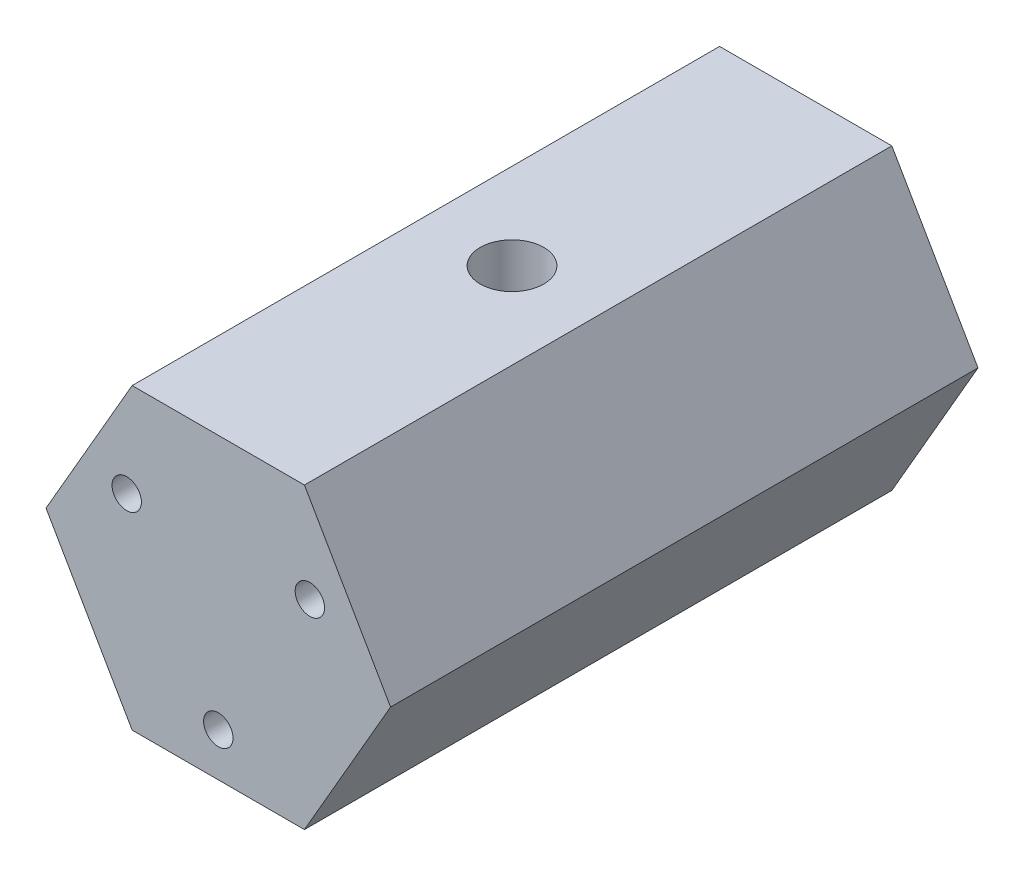
ISO-10303-21;
HEADER;
FILE_DESCRIPTION(('STEP AP214'),'2;1');
FILE_NAME('part.step','',(''),(''),'','','');
FILE_SCHEMA(('AUTOMOTIVE_DESIGN { 1 0 10303 214 1 1 1 1 }'));
ENDSEC;
DATA;
#1=APPLICATION_CONTEXT('core data for automotive mechanical design processes');
#2=APPLICATION_PROTOCOL_DEFINITION('international standard','automotive_design',2000,#1);
#3=PRODUCT_CONTEXT('',#1,'mechanical');
#4=PRODUCT('Part','Part','',(#3));
#5=PRODUCT_RELATED_PRODUCT_CATEGORY('part','',(#4));
#6=PRODUCT_DEFINITION_FORMATION('','',#4);
#7=PRODUCT_DEFINITION_CONTEXT('part definition',#1,'design');
#8=PRODUCT_DEFINITION('design','',#6,#7);
#9=PRODUCT_DEFINITION_SHAPE('','',#8);
#10=(LENGTH_UNIT() NAMED_UNIT(*) SI_UNIT(.MILLI.,.METRE.));
#11=(NAMED_UNIT(*) PLANE_ANGLE_UNIT() SI_UNIT($,.RADIAN.));
#12=(NAMED_UNIT(*) SI_UNIT($,.STERADIAN.) SOLID_ANGLE_UNIT());
#13=UNCERTAINTY_MEASURE_WITH_UNIT(LENGTH_MEASURE(1.E-05),#10,'distance_accuracy_value','');
#14=(GEOMETRIC_REPRESENTATION_CONTEXT(3) GLOBAL_UNCERTAINTY_ASSIGNED_CONTEXT((#13)) GLOBAL_UNIT_ASSIGNED_CONTEXT((#10,
#11,#12)) REPRESENTATION_CONTEXT('',''));
#15=CARTESIAN_POINT('',(0.,0.,0.));
#16=DIRECTION('',(0.,0.,1.));
#17=DIRECTION('',(1.,0.,0.));
#18=AXIS2_PLACEMENT_3D('',#15,#16,#17);
#19=CARTESIAN_POINT('',(0.,-9.,50.));
#20=DIRECTION('',(0.,0.,-1.));
#21=DIRECTION('',(-1.,0.,0.));
#22=AXIS2_PLACEMENT_3D('',#19,#20,#21);
#23=CYLINDRICAL_SURFACE('',#22,1.25);
#24=CARTESIAN_POINT('',(-1.25,-9.,27.3989718651956));
#25=CARTESIAN_POINT('',(-1.2499962908613,-9.06586986361938,27.398976108096));
#26=CARTESIAN_POINT('',(-1.24475969173911,-9.13183941692029,27.401724798307));
#27=CARTESIAN_POINT('',(-1.22405351673539,-9.26181198084871,27.4123405674276));
#28=CARTESIAN_POINT('',(-1.20855931274693,-9.32580986961136,27.4202199642128));
#29=CARTESIAN_POINT('',(-1.1681089062806,-9.4497210916039,27.4399973431834));
#30=CARTESIAN_POINT('',(-1.14319733296454,-9.5096521416213,27.4518763425534));
#31=CARTESIAN_POINT('',(-1.08475416077961,-9.6244696071343,27.4782855403419));
#32=CARTESIAN_POINT('',(-1.05122324496487,-9.67935642190105,27.492815528652));
#33=CARTESIAN_POINT('',(-0.973737596481966,-9.78677914162772,27.5241362491608));
#34=CARTESIAN_POINT('',(-0.929218016269601,-9.83888244410461,27.5410140158933));
#35=CARTESIAN_POINT('',(-0.832198977115679,-9.93521174089873,27.5744208840005));
#36=CARTESIAN_POINT('',(-0.779696018983542,-9.97943426244286,27.5909498288478));
#37=CARTESIAN_POINT('',(-0.664629367480696,-10.0611387690122,27.6228969271712));
#38=CARTESIAN_POINT('',(-0.601668900352655,-10.0981100931469,27.6382024312842));
#39=CARTESIAN_POINT('',(-0.469583995016043,-10.1607429880959,27.6648798127316));
#40=CARTESIAN_POINT('',(-0.400462917397401,-10.1864106801457,27.6762538183636));
#41=CARTESIAN_POINT('',(-0.262583411801329,-10.2240645190013,27.6931645402977));
#42=CARTESIAN_POINT('',(-0.194070526797673,-10.2368032206962,27.6990206973328));
#43=CARTESIAN_POINT('',(-0.0556473489475123,-10.250693711679,27.7054131334755));
#44=CARTESIAN_POINT('',(0.0142622175853111,-10.2518513739671,27.705952109041));
#45=CARTESIAN_POINT('',(0.147926390209878,-10.242887277595,27.7018186229592));
#46=CARTESIAN_POINT('',(0.211751347651894,-10.2335998731223,27.6975316356642));
#47=CARTESIAN_POINT('',(0.336816704159386,-10.2054723055395,27.6847854427952));
#48=CARTESIAN_POINT('',(0.398056911035302,-10.1866314334303,27.6763259275634));
#49=CARTESIAN_POINT('',(0.517342250750538,-10.1397488785234,27.6558696183459));
#50=CARTESIAN_POINT('',(0.575325643467709,-10.1115733627662,27.6438216457579));
#51=CARTESIAN_POINT('',(0.685891819018301,-10.0469748797201,27.6173183976194));
#52=CARTESIAN_POINT('',(0.738472610891999,-10.0105488877093,27.6028622397153));
#53=CARTESIAN_POINT('',(0.841429586015191,-9.92695915150233,27.5715161570508));
#54=CARTESIAN_POINT('',(0.891252613899297,-9.8791517350186,27.5545238010416));
#55=CARTESIAN_POINT('',(0.982446372854443,-9.77591687708416,27.5208595496417));
#56=CARTESIAN_POINT('',(1.02381222041914,-9.72048506373543,27.5041878444122));
#57=CARTESIAN_POINT('',(1.09882835295182,-9.60027521438755,27.4722230091738));
#58=CARTESIAN_POINT('',(1.13201318234461,-9.53517634292615,27.4570344118266));
#59=CARTESIAN_POINT('',(1.18671513185648,-9.39943535417648,27.4310902831621));
#60=CARTESIAN_POINT('',(1.20824275446202,-9.32879829240236,27.4203307635986));
#61=CARTESIAN_POINT('',(1.23744013480248,-9.18953090961133,27.4055267075853));
#62=CARTESIAN_POINT('',(1.24601720947144,-9.12113867690143,27.4010443158241));
#63=CARTESIAN_POINT('',(1.25178108091602,-8.98375987560681,27.3980459872056));
#64=CARTESIAN_POINT('',(1.24897361665329,-8.91477362396575,27.3995270441629));
#65=CARTESIAN_POINT('',(1.23287972640388,-8.78449739492194,27.4078288141744));
#66=CARTESIAN_POINT('',(1.22052158557729,-8.72305819069472,27.4141761321361));
#67=CARTESIAN_POINT('',(1.18698406740991,-8.60320852976553,27.4308399228512));
#68=CARTESIAN_POINT('',(1.16580227607406,-8.54479890682478,27.4411574817334));
#69=CARTESIAN_POINT('',(1.11416745221313,-8.42965431687843,27.4651653096152));
#70=CARTESIAN_POINT('',(1.08333435705616,-8.37311844841991,27.47898836368));
#71=CARTESIAN_POINT('',(1.01362317458948,-8.26571693468951,27.5082987896109));
#72=CARTESIAN_POINT('',(0.974741147814142,-8.2148540848464,27.5237869746671));
#73=CARTESIAN_POINT('',(0.885277137482153,-8.11470408564449,27.5566281182141));
#74=CARTESIAN_POINT('',(0.833897823239853,-8.06613460280701,27.5740070833917));
#75=CARTESIAN_POINT('',(0.72337129677926,-7.97812694643838,27.6072260640207));
#76=CARTESIAN_POINT('',(0.664222575831666,-7.93869055056797,27.6230657795255));
#77=CARTESIAN_POINT('',(0.53863346210164,-7.8697031568715,27.6517235015948));
#78=CARTESIAN_POINT('',(0.472106525645689,-7.84029066286391,27.6644985011312));
#79=CARTESIAN_POINT('',(0.334293907815896,-7.79333693299922,27.6852662042964));
#80=CARTESIAN_POINT('',(0.263011822407703,-7.77578683583925,27.6932624771528));
#81=CARTESIAN_POINT('',(0.124046543478271,-7.75435046641577,27.7030774611194));
#82=CARTESIAN_POINT('',(0.0565498732469495,-7.74945866858606,27.7053503634318));
#83=CARTESIAN_POINT('',(-0.0783182584763698,-7.75063610539858,27.704805843157));
#84=CARTESIAN_POINT('',(-0.145689747620479,-7.7567025316607,27.7019897247871));
#85=CARTESIAN_POINT('',(-0.274831857038451,-7.77891667400426,27.6918434330981));
#86=CARTESIAN_POINT('',(-0.336713300477791,-7.794537995852,27.6847492172009));
#87=CARTESIAN_POINT('',(-0.456913694075798,-7.83477514286399,27.6669253090312));
#88=CARTESIAN_POINT('',(-0.515232053746472,-7.85939245418455,27.6561950160925));
#89=CARTESIAN_POINT('',(-0.629602207885975,-7.9181398119282,27.6314911999344));
#90=CARTESIAN_POINT('',(-0.68542990866064,-7.95265194593216,27.6173922548961));
#91=CARTESIAN_POINT('',(-0.790746703906991,-8.0297002621939,27.5875252904111));
#92=CARTESIAN_POINT('',(-0.840232958219822,-8.07224001885893,27.5717565288339));
#93=CARTESIAN_POINT('',(-0.935899775436062,-8.16838980788918,27.5385892333557));
#94=CARTESIAN_POINT('',(-0.981435111736464,-8.22263564101142,27.5211667030821));
#95=CARTESIAN_POINT('',(-1.06292754091002,-8.33841288529576,27.4879095982203));
#96=CARTESIAN_POINT('',(-1.09887803635555,-8.39994927281872,27.4720761220588));
#97=CARTESIAN_POINT('',(-1.16038377050151,-8.52965979502022,27.4438165122321));
#98=CARTESIAN_POINT('',(-1.18581696607985,-8.59790107220055,27.4314308986784));
#99=CARTESIAN_POINT('',(-1.22446825578866,-8.73837809131262,27.4122029737783));
#100=CARTESIAN_POINT('',(-1.23772735891815,-8.81059954770739,27.4053420618952));
#101=CARTESIAN_POINT('',(-1.24636902621053,-8.90281123520539,27.4008603958595));
#102=CARTESIAN_POINT('',(-1.2477291025588,-8.92221436170823,27.4001539569982));
#103=CARTESIAN_POINT('',(-1.2495451565744,-8.96107542169026,27.3992090548565));
#104=CARTESIAN_POINT('',(-1.25000109616862,-8.98053335744292,27.3989706112834));
#105=CARTESIAN_POINT('',(-1.25,-9.,27.3989718651956));
#106=B_SPLINE_CURVE_WITH_KNOTS('',3,(#24,#25,#26,#27,#28,#29,#30,#31,#32,#33,#34,#35,#36,#37,
#38,#39,#40,#41,#42,#43,#44,#45,#46,#47,#48,#49,#50,#51,#52,#53,#54,#55,#56,#57,#58,#59,#60,#61,
#62,#63,#64,#65,#66,#67,#68,#69,#70,#71,#72,#73,#74,#75,#76,#77,#78,#79,#80,#81,#82,#83,#84,#85,
#86,#87,#88,#89,#90,#91,#92,#93,#94,#95,#96,#97,#98,#99,#100,#101,#102,#103,#104,#105),
.UNSPECIFIED.,.T.,.F.,(4,2,2,2,2,2,2,2,2,2,2,2,2,2,2,2,2,2,2,2,2,2,2,2,2,2,2,2,2,2,2,2,2,2,2,2,
2,2,2,2,4),(0.,0.197527759686264,0.395531504143049,0.59260843343527,0.789669749850622,
1.00050754653747,1.21143802325072,1.43408138198829,1.65660402436703,1.86526736114843,
2.07382487478769,2.26683616648361,2.45986178437431,2.65578412759156,2.85177841484428,
3.06418214037597,3.27670817184753,3.49943184569688,3.72195452278757,3.92801635582216,
4.1339743257215,4.32210098743811,4.51027915112595,4.70707257792227,4.90396255190884,
5.12138831106846,5.33885635439823,5.55921775927923,5.77941437000867,5.98149156508768,
6.1835169790516,6.37530576455118,6.56712624829417,6.76768042333846,6.96832410944356,
7.18613703092828,7.40409949235945,7.62452466126934,7.84420456404469,7.90257784995653,
7.96095359391027),.UNSPECIFIED.);
#107=CARTESIAN_POINT('',(-1.25,-9.,27.3989718651956));
#108=VERTEX_POINT('',#107);
#109=EDGE_CURVE('E52',#108,#108,#106,.T.);
#110=ORIENTED_EDGE('',*,*,#109,.F.);
#111=EDGE_LOOP('',(#110));
#112=FACE_BOUND('',#111,.T.);
#113=CARTESIAN_POINT('',(0.,-9.,50.));
#114=DIRECTION('',(0.,0.,1.));
#115=DIRECTION('',(1.,0.,0.));
#116=AXIS2_PLACEMENT_3D('',#113,#114,#115);
#117=CIRCLE('',#116,1.25);
#118=CARTESIAN_POINT('',(1.25,-9.,50.));
#119=VERTEX_POINT('',#118);
#120=EDGE_CURVE('E193',#119,#119,#117,.T.);
#121=ORIENTED_EDGE('',*,*,#120,.T.);
#122=EDGE_LOOP('',(#121));
#123=FACE_BOUND('',#122,.T.);
#124=ADVANCED_FACE('F48',(#112,#123),#23,.F.);
#125=CARTESIAN_POINT('',(0.,0.,50.));
#126=DIRECTION('',(0.,0.,1.));
#127=DIRECTION('',(1.,0.,0.));
#128=AXIS2_PLACEMENT_3D('',#125,#126,#127);
#129=PLANE('',#128);
#130=CARTESIAN_POINT('',(7.79422863405994,4.5,50.));
#131=DIRECTION('',(0.,0.,1.));
#132=DIRECTION('',(1.,0.,0.));
#133=AXIS2_PLACEMENT_3D('',#130,#131,#132);
#134=CIRCLE('',#133,1.25);
#135=CARTESIAN_POINT('',(9.04422863405995,4.5,50.));
#136=VERTEX_POINT('',#135);
#137=EDGE_CURVE('E199',#136,#136,#134,.T.);
#138=ORIENTED_EDGE('',*,*,#137,.F.);
#139=EDGE_LOOP('',(#138));
#140=FACE_BOUND('',#139,.T.);
#141=DIRECTION('',(0.5,-0.866025403784438,0.));
#142=VECTOR('',#141,1.);
#143=CARTESIAN_POINT('',(-14.6646968374165,0.,50.));
#144=LINE('',#143,#142);
#145=CARTESIAN_POINT('',(-14.6646968374165,0.,50.));
#146=VERTEX_POINT('',#145);
#147=CARTESIAN_POINT('',(-7.33234841870824,-12.7,50.));
#148=VERTEX_POINT('',#147);
#149=EDGE_CURVE('E152',#146,#148,#144,.T.);
#150=ORIENTED_EDGE('',*,*,#149,.T.);
#151=DIRECTION('',(1.,0.,0.));
#152=VECTOR('',#151,1.);
#153=CARTESIAN_POINT('',(-7.33234841870824,-12.7,50.));
#154=LINE('',#153,#152);
#155=CARTESIAN_POINT('',(7.33234841870825,-12.7,50.));
#156=VERTEX_POINT('',#155);
#157=EDGE_CURVE('E109',#148,#156,#154,.T.);
#158=ORIENTED_EDGE('',*,*,#157,.T.);
#159=DIRECTION('',(0.5,0.866025403784439,0.));
#160=VECTOR('',#159,1.);
#161=CARTESIAN_POINT('',(7.33234841870825,-12.7,50.));
#162=LINE('',#161,#160);
#163=CARTESIAN_POINT('',(14.6646968374165,0.,50.));
#164=VERTEX_POINT('',#163);
#165=EDGE_CURVE('E123',#156,#164,#162,.T.);
#166=ORIENTED_EDGE('',*,*,#165,.T.);
#167=DIRECTION('',(-0.5,0.866025403784438,0.));
#168=VECTOR('',#167,1.);
#169=CARTESIAN_POINT('',(14.6646968374165,0.,50.));
#170=LINE('',#169,#168);
#171=CARTESIAN_POINT('',(7.33234841870824,12.7,50.));
#172=VERTEX_POINT('',#171);
#173=EDGE_CURVE('E116',#164,#172,#170,.T.);
#174=ORIENTED_EDGE('',*,*,#173,.T.);
#175=DIRECTION('',(-1.,0.,0.));
#176=VECTOR('',#175,1.);
#177=CARTESIAN_POINT('',(7.33234841870824,12.7,50.));
#178=LINE('',#177,#176);
#179=CARTESIAN_POINT('',(-7.33234841870825,12.7,50.));
#180=VERTEX_POINT('',#179);
#181=EDGE_CURVE('E121',#172,#180,#178,.T.);
#182=ORIENTED_EDGE('',*,*,#181,.T.);
#183=DIRECTION('',(-0.5,-0.866025403784439,0.));
#184=VECTOR('',#183,1.);
#185=CARTESIAN_POINT('',(-7.33234841870825,12.7,50.));
#186=LINE('',#185,#184);
#187=EDGE_CURVE('E72',#180,#146,#186,.T.);
#188=ORIENTED_EDGE('',*,*,#187,.T.);
#189=EDGE_LOOP('',(#150,#158,#166,#174,#182,#188));
#190=FACE_BOUND('',#189,.T.);
#191=CARTESIAN_POINT('',(-7.79422863405994,4.5,50.));
#192=DIRECTION('',(0.,0.,1.));
#193=DIRECTION('',(1.,0.,0.));
#194=AXIS2_PLACEMENT_3D('',#191,#192,#193);
#195=CIRCLE('',#194,1.25);
#196=CARTESIAN_POINT('',(-6.54422863405995,4.5,50.));
#197=VERTEX_POINT('',#196);
#198=EDGE_CURVE('E145',#197,#197,#195,.T.);
#199=ORIENTED_EDGE('',*,*,#198,.F.);
#200=EDGE_LOOP('',(#199));
#201=FACE_BOUND('',#200,.T.);
#202=ORIENTED_EDGE('',*,*,#120,.F.);
#203=EDGE_LOOP('',(#202));
#204=FACE_BOUND('',#203,.T.);
#205=ADVANCED_FACE('F118',(#140,#190,#201,#204),#129,.T.);
#206=CARTESIAN_POINT('',(0.,0.,0.));
#207=DIRECTION('',(0.,0.,1.));
#208=DIRECTION('',(1.,0.,0.));
#209=AXIS2_PLACEMENT_3D('',#206,#207,#208);
#210=PLANE('',#209);
#211=DIRECTION('',(0.5,-0.866025403784438,0.));
#212=VECTOR('',#211,1.);
#213=CARTESIAN_POINT('',(-14.6646968374165,0.,0.));
#214=LINE('',#213,#212);
#215=CARTESIAN_POINT('',(-14.6646968374165,0.,0.));
#216=VERTEX_POINT('',#215);
#217=CARTESIAN_POINT('',(-7.33234841870824,-12.7,0.));
#218=VERTEX_POINT('',#217);
#219=EDGE_CURVE('E141',#216,#218,#214,.T.);
#220=ORIENTED_EDGE('',*,*,#219,.F.);
#221=DIRECTION('',(-0.5,-0.866025403784439,0.));
#222=VECTOR('',#221,1.);
#223=CARTESIAN_POINT('',(-7.33234841870825,12.7,0.));
#224=LINE('',#223,#222);
#225=CARTESIAN_POINT('',(-7.33234841870825,12.7,0.));
#226=VERTEX_POINT('',#225);
#227=EDGE_CURVE('E101',#226,#216,#224,.T.);
#228=ORIENTED_EDGE('',*,*,#227,.F.);
#229=DIRECTION('',(-1.,0.,0.));
#230=VECTOR('',#229,1.);
#231=CARTESIAN_POINT('',(7.33234841870824,12.7,0.));
#232=LINE('',#231,#230);
#233=CARTESIAN_POINT('',(7.33234841870824,12.7,0.));
#234=VERTEX_POINT('',#233);
#235=EDGE_CURVE('E95',#234,#226,#232,.T.);
#236=ORIENTED_EDGE('',*,*,#235,.F.);
#237=DIRECTION('',(-0.5,0.866025403784438,0.));
#238=VECTOR('',#237,1.);
#239=CARTESIAN_POINT('',(14.6646968374165,0.,0.));
#240=LINE('',#239,#238);
#241=CARTESIAN_POINT('',(14.6646968374165,0.,0.));
#242=VERTEX_POINT('',#241);
#243=EDGE_CURVE('E131',#242,#234,#240,.T.);
#244=ORIENTED_EDGE('',*,*,#243,.F.);
#245=DIRECTION('',(0.5,0.866025403784439,0.));
#246=VECTOR('',#245,1.);
#247=CARTESIAN_POINT('',(7.33234841870825,-12.7,0.));
#248=LINE('',#247,#246);
#249=CARTESIAN_POINT('',(7.33234841870825,-12.7,0.));
#250=VERTEX_POINT('',#249);
#251=EDGE_CURVE('E147',#250,#242,#248,.T.);
#252=ORIENTED_EDGE('',*,*,#251,.F.);
#253=DIRECTION('',(1.,0.,0.));
#254=VECTOR('',#253,1.);
#255=CARTESIAN_POINT('',(-7.33234841870824,-12.7,0.));
#256=LINE('',#255,#254);
#257=EDGE_CURVE('E144',#218,#250,#256,.T.);
#258=ORIENTED_EDGE('',*,*,#257,.F.);
#259=EDGE_LOOP('',(#220,#228,#236,#244,#252,#258));
#260=FACE_BOUND('',#259,.T.);
#261=CARTESIAN_POINT('',(-7.79422863405994,4.5,0.));
#262=DIRECTION('',(0.,0.,1.));
#263=DIRECTION('',(1.,0.,0.));
#264=AXIS2_PLACEMENT_3D('',#261,#262,#263);
#265=CIRCLE('',#264,1.25);
#266=CARTESIAN_POINT('',(-6.54422863405995,4.5,0.));
#267=VERTEX_POINT('',#266);
#268=EDGE_CURVE('E207',#267,#267,#265,.T.);
#269=ORIENTED_EDGE('',*,*,#268,.T.);
#270=EDGE_LOOP('',(#269));
#271=FACE_BOUND('',#270,.T.);
#272=CARTESIAN_POINT('',(7.79422863405994,4.5,0.));
#273=DIRECTION('',(0.,0.,1.));
#274=DIRECTION('',(1.,0.,0.));
#275=AXIS2_PLACEMENT_3D('',#272,#273,#274);
#276=CIRCLE('',#275,1.25);
#277=CARTESIAN_POINT('',(9.04422863405995,4.5,0.));
#278=VERTEX_POINT('',#277);
#279=EDGE_CURVE('E195',#278,#278,#276,.T.);
#280=ORIENTED_EDGE('',*,*,#279,.T.);
#281=EDGE_LOOP('',(#280));
#282=FACE_BOUND('',#281,.T.);
#283=CARTESIAN_POINT('',(0.,-9.,0.));
#284=DIRECTION('',(0.,0.,1.));
#285=DIRECTION('',(1.,0.,0.));
#286=AXIS2_PLACEMENT_3D('',#283,#284,#285);
#287=CIRCLE('',#286,1.25);
#288=CARTESIAN_POINT('',(1.25,-9.,0.));
#289=VERTEX_POINT('',#288);
#290=EDGE_CURVE('E196',#289,#289,#287,.T.);
#291=ORIENTED_EDGE('',*,*,#290,.T.);
#292=EDGE_LOOP('',(#291));
#293=FACE_BOUND('',#292,.T.);
#294=ADVANCED_FACE('F186',(#260,#271,#282,#293),#210,.F.);
#295=CARTESIAN_POINT('',(-14.6646968374165,0.,50.));
#296=DIRECTION('',(0.866025403784438,0.5,0.));
#297=DIRECTION('',(-0.5,0.866025403784438,0.));
#298=AXIS2_PLACEMENT_3D('',#295,#296,#297);
#299=PLANE('',#298);
#300=ORIENTED_EDGE('',*,*,#219,.T.);
#301=DIRECTION('',(0.,0.,-1.));
#302=VECTOR('',#301,1.);
#303=CARTESIAN_POINT('',(-7.33234841870824,-12.7,50.));
#304=LINE('',#303,#302);
#305=EDGE_CURVE('E11',#148,#218,#304,.T.);
#306=ORIENTED_EDGE('',*,*,#305,.F.);
#307=ORIENTED_EDGE('',*,*,#149,.F.);
#308=DIRECTION('',(0.,0.,-1.));
#309=VECTOR('',#308,1.);
#310=CARTESIAN_POINT('',(-14.6646968374165,0.,50.));
#311=LINE('',#310,#309);
#312=EDGE_CURVE('E137',#146,#216,#311,.T.);
#313=ORIENTED_EDGE('',*,*,#312,.T.);
#314=EDGE_LOOP('',(#300,#306,#307,#313));
#315=FACE_BOUND('',#314,.T.);
#316=ADVANCED_FACE('F50',(#315),#299,.F.);
#317=CARTESIAN_POINT('',(-7.33234841870824,-12.7,50.));
#318=DIRECTION('',(0.,1.,0.));
#319=DIRECTION('',(-1.,0.,0.));
#320=AXIS2_PLACEMENT_3D('',#317,#318,#319);
#321=PLANE('',#320);
#322=CARTESIAN_POINT('',(0.,-12.7,25.));
#323=DIRECTION('',(0.,1.,0.));
#324=DIRECTION('',(0.,0.,1.));
#325=AXIS2_PLACEMENT_3D('',#322,#323,#324);
#326=CIRCLE('',#325,2.70509999999999);
#327=CARTESIAN_POINT('',(0.,-12.7,27.7051));
#328=VERTEX_POINT('',#327);
#329=EDGE_CURVE('E162',#328,#328,#326,.T.);
#330=ORIENTED_EDGE('',*,*,#329,.T.);
#331=EDGE_LOOP('',(#330));
#332=FACE_BOUND('',#331,.T.);
#333=ORIENTED_EDGE('',*,*,#257,.T.);
#334=DIRECTION('',(0.,0.,-1.));
#335=VECTOR('',#334,1.);
#336=CARTESIAN_POINT('',(7.33234841870825,-12.7,50.));
#337=LINE('',#336,#335);
#338=EDGE_CURVE('E63',#156,#250,#337,.T.);
#339=ORIENTED_EDGE('',*,*,#338,.F.);
#340=ORIENTED_EDGE('',*,*,#157,.F.);
#341=ORIENTED_EDGE('',*,*,#305,.T.);
#342=EDGE_LOOP('',(#333,#339,#340,#341));
#343=FACE_BOUND('',#342,.T.);
#344=ADVANCED_FACE('F216',(#332,#343),#321,.F.);
#345=CARTESIAN_POINT('',(7.33234841870825,-12.7,50.));
#346=DIRECTION('',(-0.866025403784439,0.5,0.));
#347=DIRECTION('',(-0.5,-0.866025403784439,0.));
#348=AXIS2_PLACEMENT_3D('',#345,#346,#347);
#349=PLANE('',#348);
#350=ORIENTED_EDGE('',*,*,#251,.T.);
#351=DIRECTION('',(0.,0.,-1.));
#352=VECTOR('',#351,1.);
#353=CARTESIAN_POINT('',(14.6646968374165,0.,50.));
#354=LINE('',#353,#352);
#355=EDGE_CURVE('E132',#164,#242,#354,.T.);
#356=ORIENTED_EDGE('',*,*,#355,.F.);
#357=ORIENTED_EDGE('',*,*,#165,.F.);
#358=ORIENTED_EDGE('',*,*,#338,.T.);
#359=EDGE_LOOP('',(#350,#356,#357,#358));
#360=FACE_BOUND('',#359,.T.);
#361=ADVANCED_FACE('F219',(#360),#349,.F.);
#362=CARTESIAN_POINT('',(14.6646968374165,0.,50.));
#363=DIRECTION('',(-0.866025403784438,-0.5,0.));
#364=DIRECTION('',(0.5,-0.866025403784439,0.));
#365=AXIS2_PLACEMENT_3D('',#362,#363,#364);
#366=PLANE('',#365);
#367=ORIENTED_EDGE('',*,*,#243,.T.);
#368=DIRECTION('',(0.,0.,-1.));
#369=VECTOR('',#368,1.);
#370=CARTESIAN_POINT('',(7.33234841870824,12.7,50.));
#371=LINE('',#370,#369);
#372=EDGE_CURVE('E128',#172,#234,#371,.T.);
#373=ORIENTED_EDGE('',*,*,#372,.F.);
#374=ORIENTED_EDGE('',*,*,#173,.F.);
#375=ORIENTED_EDGE('',*,*,#355,.T.);
#376=EDGE_LOOP('',(#367,#373,#374,#375));
#377=FACE_BOUND('',#376,.T.);
#378=ADVANCED_FACE('F129',(#377),#366,.F.);
#379=CARTESIAN_POINT('',(7.33234841870824,12.7,50.));
#380=DIRECTION('',(0.,-1.,0.));
#381=DIRECTION('',(0.,0.,-1.));
#382=AXIS2_PLACEMENT_3D('',#379,#380,#381);
#383=PLANE('',#382);
#384=CARTESIAN_POINT('',(0.,12.7,25.));
#385=DIRECTION('',(0.,1.,0.));
#386=DIRECTION('',(0.,0.,1.));
#387=AXIS2_PLACEMENT_3D('',#384,#385,#386);
#388=CIRCLE('',#387,2.70509999999999);
#389=CARTESIAN_POINT('',(0.,12.7,27.7051));
#390=VERTEX_POINT('',#389);
#391=EDGE_CURVE('E248',#390,#390,#388,.T.);
#392=ORIENTED_EDGE('',*,*,#391,.F.);
#393=EDGE_LOOP('',(#392));
#394=FACE_BOUND('',#393,.T.);
#395=ORIENTED_EDGE('',*,*,#235,.T.);
#396=DIRECTION('',(0.,0.,-1.));
#397=VECTOR('',#396,1.);
#398=CARTESIAN_POINT('',(-7.33234841870825,12.7,50.));
#399=LINE('',#398,#397);
#400=EDGE_CURVE('E133',#180,#226,#399,.T.);
#401=ORIENTED_EDGE('',*,*,#400,.F.);
#402=ORIENTED_EDGE('',*,*,#181,.F.);
#403=ORIENTED_EDGE('',*,*,#372,.T.);
#404=EDGE_LOOP('',(#395,#401,#402,#403));
#405=FACE_BOUND('',#404,.T.);
#406=ADVANCED_FACE('F135',(#394,#405),#383,.F.);
#407=CARTESIAN_POINT('',(-7.33234841870825,12.7,50.));
#408=DIRECTION('',(0.866025403784439,-0.5,0.));
#409=DIRECTION('',(0.5,0.866025403784439,0.));
#410=AXIS2_PLACEMENT_3D('',#407,#408,#409);
#411=PLANE('',#410);
#412=ORIENTED_EDGE('',*,*,#227,.T.);
#413=ORIENTED_EDGE('',*,*,#312,.F.);
#414=ORIENTED_EDGE('',*,*,#187,.F.);
#415=ORIENTED_EDGE('',*,*,#400,.T.);
#416=EDGE_LOOP('',(#412,#413,#414,#415));
#417=FACE_BOUND('',#416,.T.);
#418=ADVANCED_FACE('F224',(#417),#411,.F.);
#419=CARTESIAN_POINT('',(-7.79422863405994,4.5,50.));
#420=DIRECTION('',(0.,0.,-1.));
#421=DIRECTION('',(-1.,0.,0.));
#422=AXIS2_PLACEMENT_3D('',#419,#420,#421);
#423=CYLINDRICAL_SURFACE('',#422,1.25);
#424=ORIENTED_EDGE('',*,*,#198,.T.);
#425=EDGE_LOOP('',(#424));
#426=FACE_BOUND('',#425,.T.);
#427=ORIENTED_EDGE('',*,*,#268,.F.);
#428=EDGE_LOOP('',(#427));
#429=FACE_BOUND('',#428,.T.);
#430=ADVANCED_FACE('F226',(#426,#429),#423,.F.);
#431=CARTESIAN_POINT('',(7.79422863405994,4.5,50.));
#432=DIRECTION('',(0.,0.,-1.));
#433=DIRECTION('',(-1.,0.,0.));
#434=AXIS2_PLACEMENT_3D('',#431,#432,#433);
#435=CYLINDRICAL_SURFACE('',#434,1.25);
#436=ORIENTED_EDGE('',*,*,#137,.T.);
#437=EDGE_LOOP('',(#436));
#438=FACE_BOUND('',#437,.T.);
#439=ORIENTED_EDGE('',*,*,#279,.F.);
#440=EDGE_LOOP('',(#439));
#441=FACE_BOUND('',#440,.T.);
#442=ADVANCED_FACE('F175',(#438,#441),#435,.F.);
#443=CARTESIAN_POINT('',(-1.25,-9.,22.6010281348044));
#444=CARTESIAN_POINT('',(-1.2499962908613,-8.93413013638061,22.601023891904));
#445=CARTESIAN_POINT('',(-1.24475969173911,-8.86816058307971,22.598275201693));
#446=CARTESIAN_POINT('',(-1.22405351673539,-8.73818801915128,22.5876594325724));
#447=CARTESIAN_POINT('',(-1.20855931274693,-8.67419013038864,22.5797800357872));
#448=CARTESIAN_POINT('',(-1.1681089062806,-8.55027890839609,22.5600026568166));
#449=CARTESIAN_POINT('',(-1.14319733296454,-8.4903478583787,22.5481236574466));
#450=CARTESIAN_POINT('',(-1.08475416077961,-8.37553039286569,22.5217144596581));
#451=CARTESIAN_POINT('',(-1.05122324496487,-8.32064357809895,22.507184471348));
#452=CARTESIAN_POINT('',(-0.973737596481966,-8.21322085837228,22.4758637508392));
#453=CARTESIAN_POINT('',(-0.929218016269601,-8.16111755589539,22.4589859841067));
#454=CARTESIAN_POINT('',(-0.832198977115679,-8.06478825910126,22.4255791159995));
#455=CARTESIAN_POINT('',(-0.779696018983542,-8.02056573755714,22.4090501711522));
#456=CARTESIAN_POINT('',(-0.664629367480696,-7.93886123098779,22.3771030728288));
#457=CARTESIAN_POINT('',(-0.601668900352655,-7.90188990685314,22.3617975687159));
#458=CARTESIAN_POINT('',(-0.469583995016043,-7.83925701190406,22.3351201872684));
#459=CARTESIAN_POINT('',(-0.400462917397401,-7.81358931985428,22.3237461816364));
#460=CARTESIAN_POINT('',(-0.262583411801329,-7.77593548099866,22.3068354597023));
#461=CARTESIAN_POINT('',(-0.194070526797672,-7.76319677930377,22.3009793026672));
#462=CARTESIAN_POINT('',(-0.0556473489475116,-7.74930628832101,22.2945868665245));
#463=CARTESIAN_POINT('',(0.0142622175853117,-7.74814862603294,22.294047890959));
#464=CARTESIAN_POINT('',(0.147926390209878,-7.75711272240499,22.2981813770408));
#465=CARTESIAN_POINT('',(0.211751347651894,-7.76640012687767,22.3024683643358));
#466=CARTESIAN_POINT('',(0.336816704159386,-7.79452769446055,22.3152145572048));
#467=CARTESIAN_POINT('',(0.398056911035302,-7.81336856656969,22.3236740724366));
#468=CARTESIAN_POINT('',(0.517342250750539,-7.86025112147657,22.3441303816541));
#469=CARTESIAN_POINT('',(0.575325643467709,-7.8884266372338,22.3561783542421));
#470=CARTESIAN_POINT('',(0.685891819018301,-7.95302512027992,22.3826816023806));
#471=CARTESIAN_POINT('',(0.738472610891999,-7.98945111229067,22.3971377602847));
#472=CARTESIAN_POINT('',(0.841429586015191,-8.07304084849766,22.4284838429492));
#473=CARTESIAN_POINT('',(0.891252613899297,-8.1208482649814,22.4454761989584));
#474=CARTESIAN_POINT('',(0.982446372854443,-8.22408312291583,22.4791404503583));
#475=CARTESIAN_POINT('',(1.02381222041914,-8.27951493626457,22.4958121555878));
#476=CARTESIAN_POINT('',(1.09882835295182,-8.39972478561244,22.5277769908262));
#477=CARTESIAN_POINT('',(1.13201318234461,-8.46482365707384,22.5429655881734));
#478=CARTESIAN_POINT('',(1.18671513185648,-8.60056464582351,22.5689097168379));
#479=CARTESIAN_POINT('',(1.20824275446202,-8.67120170759763,22.5796692364014));
#480=CARTESIAN_POINT('',(1.23744013480248,-8.81046909038867,22.5944732924147));
#481=CARTESIAN_POINT('',(1.24601720947144,-8.87886132309857,22.5989556841759));
#482=CARTESIAN_POINT('',(1.25178108091603,-9.01624012439318,22.6019540127944));
#483=CARTESIAN_POINT('',(1.24897361665329,-9.08522637603424,22.6004729558371));
#484=CARTESIAN_POINT('',(1.23287972640388,-9.21550260507806,22.5921711858256));
#485=CARTESIAN_POINT('',(1.22052158557729,-9.27694180930528,22.5858238678639));
#486=CARTESIAN_POINT('',(1.18698406740991,-9.39679147023447,22.5691600771488));
#487=CARTESIAN_POINT('',(1.16580227607406,-9.45520109317521,22.5588425182666));
#488=CARTESIAN_POINT('',(1.11416745221313,-9.57034568312157,22.5348346903848));
#489=CARTESIAN_POINT('',(1.08333435705616,-9.62688155158009,22.52101163632));
#490=CARTESIAN_POINT('',(1.01362317458948,-9.73428306531049,22.4917012103891));
#491=CARTESIAN_POINT('',(0.974741147814142,-9.78514591515359,22.4762130253329));
#492=CARTESIAN_POINT('',(0.885277137482153,-9.8852959143555,22.4433718817859));
#493=CARTESIAN_POINT('',(0.833897823239854,-9.93386539719298,22.4259929166083));
#494=CARTESIAN_POINT('',(0.72337129677926,-10.0218730535616,22.3927739359793));
#495=CARTESIAN_POINT('',(0.664222575831666,-10.061309449432,22.3769342204745));
#496=CARTESIAN_POINT('',(0.53863346210164,-10.1302968431285,22.3482764984052));
#497=CARTESIAN_POINT('',(0.472106525645689,-10.1597093371361,22.3355014988688));
#498=CARTESIAN_POINT('',(0.334293907815896,-10.2066630670008,22.3147337957036));
#499=CARTESIAN_POINT('',(0.263011822407703,-10.2242131641607,22.3067375228472));
#500=CARTESIAN_POINT('',(0.124046543478271,-10.2456495335842,22.2969225388806));
#501=CARTESIAN_POINT('',(0.0565498732469496,-10.2505413314139,22.2946496365682));
#502=CARTESIAN_POINT('',(-0.0783182584763697,-10.2493638946014,22.295194156843));
#503=CARTESIAN_POINT('',(-0.145689747620478,-10.2432974683393,22.2980102752129));
#504=CARTESIAN_POINT('',(-0.274831857038451,-10.2210833259957,22.308156566902));
#505=CARTESIAN_POINT('',(-0.33671330047779,-10.205462004148,22.3152507827991));
#506=CARTESIAN_POINT('',(-0.456913694075797,-10.165224857136,22.3330746909688));
#507=CARTESIAN_POINT('',(-0.515232053746472,-10.1406075458154,22.3438049839075));
#508=CARTESIAN_POINT('',(-0.629602207885975,-10.0818601880718,22.3685088000656));
#509=CARTESIAN_POINT('',(-0.68542990866064,-10.0473480540678,22.3826077451039));
#510=CARTESIAN_POINT('',(-0.79074670390699,-9.9702997378061,22.4124747095889));
#511=CARTESIAN_POINT('',(-0.840232958219821,-9.92775998114107,22.4282434711661));
#512=CARTESIAN_POINT('',(-0.935899775436063,-9.83161019211081,22.4614107666443));
#513=CARTESIAN_POINT('',(-0.981435111736464,-9.77736435898858,22.4788332969179));
#514=CARTESIAN_POINT('',(-1.06292754091002,-9.66158711470423,22.5120904017797));
#515=CARTESIAN_POINT('',(-1.09887803635555,-9.60005072718128,22.5279238779412));
#516=CARTESIAN_POINT('',(-1.16038377050151,-9.47034020497978,22.5561834877679));
#517=CARTESIAN_POINT('',(-1.18581696607985,-9.40209892779945,22.5685691013216));
#518=CARTESIAN_POINT('',(-1.22446825578866,-9.26162190868737,22.5877970262217));
#519=CARTESIAN_POINT('',(-1.23772735891815,-9.18940045229261,22.5946579381048));
#520=CARTESIAN_POINT('',(-1.24636902621053,-9.0971887647946,22.5991396041405));
#521=CARTESIAN_POINT('',(-1.2477291025588,-9.07778563829176,22.5998460430018));
#522=CARTESIAN_POINT('',(-1.2495451565744,-9.03892457830973,22.6007909451435));
#523=CARTESIAN_POINT('',(-1.25000109616862,-9.01946664255708,22.6010293887166));
#524=CARTESIAN_POINT('',(-1.25,-9.,22.6010281348044));
#525=B_SPLINE_CURVE_WITH_KNOTS('',3,(#443,#444,#445,#446,#447,#448,#449,#450,#451,#452,#453,
#454,#455,#456,#457,#458,#459,#460,#461,#462,#463,#464,#465,#466,#467,#468,#469,#470,#471,#472,
#473,#474,#475,#476,#477,#478,#479,#480,#481,#482,#483,#484,#485,#486,#487,#488,#489,#490,#491,
#492,#493,#494,#495,#496,#497,#498,#499,#500,#501,#502,#503,#504,#505,#506,#507,#508,#509,#510,
#511,#512,#513,#514,#515,#516,#517,#518,#519,#520,#521,#522,#523,#524),.UNSPECIFIED.,.T.,.F.,(4,
2,2,2,2,2,2,2,2,2,2,2,2,2,2,2,2,2,2,2,2,2,2,2,2,2,2,2,2,2,2,2,2,2,2,2,2,2,2,2,4),(0.,
0.197527759686264,0.395531504143049,0.59260843343527,0.789669749850622,1.00050754653747,
1.21143802325072,1.43408138198829,1.65660402436703,1.86526736114843,2.07382487478769,
2.26683616648361,2.45986178437431,2.65578412759156,2.85177841484428,3.06418214037597,
3.27670817184753,3.49943184569688,3.72195452278757,3.92801635582216,4.1339743257215,
4.32210098743811,4.51027915112595,4.70707257792227,4.90396255190884,5.12138831106846,
5.33885635439823,5.55921775927923,5.77941437000867,5.98149156508768,6.1835169790516,
6.37530576455118,6.56712624829417,6.76768042333846,6.96832410944356,7.18613703092828,
7.40409949235945,7.62452466126934,7.84420456404469,7.90257784995653,7.96095359391027),.UNSPECIFIED.);
#526=CARTESIAN_POINT('',(-1.25,-9.,22.6010281348044));
#527=VERTEX_POINT('',#526);
#528=EDGE_CURVE('E157',#527,#527,#525,.T.);
#529=ORIENTED_EDGE('',*,*,#528,.F.);
#530=EDGE_LOOP('',(#529));
#531=FACE_BOUND('',#530,.T.);
#532=ORIENTED_EDGE('',*,*,#290,.F.);
#533=EDGE_LOOP('',(#532));
#534=FACE_BOUND('',#533,.T.);
#535=ADVANCED_FACE('F163',(#531,#534),#23,.F.);
#536=CARTESIAN_POINT('',(0.,12.7,25.));
#537=DIRECTION('',(0.,1.,0.));
#538=DIRECTION('',(0.,0.,1.));
#539=AXIS2_PLACEMENT_3D('',#536,#537,#538);
#540=CYLINDRICAL_SURFACE('',#539,2.70509999999999);
#541=ORIENTED_EDGE('',*,*,#109,.T.);
#542=EDGE_LOOP('',(#541));
#543=FACE_BOUND('',#542,.T.);
#544=ORIENTED_EDGE('',*,*,#528,.T.);
#545=EDGE_LOOP('',(#544));
#546=FACE_BOUND('',#545,.T.);
#547=ORIENTED_EDGE('',*,*,#329,.F.);
#548=EDGE_LOOP('',(#547));
#549=FACE_BOUND('',#548,.T.);
#550=ORIENTED_EDGE('',*,*,#391,.T.);
#551=EDGE_LOOP('',(#550));
#552=FACE_BOUND('',#551,.T.);
#553=ADVANCED_FACE('F166',(#543,#546,#549,#552),#540,.F.);
#554=CLOSED_SHELL('',(#124,#205,#294,#316,#344,#361,#378,#406,#418,#430,#442,#535,#553));
#555=MANIFOLD_SOLID_BREP('B2',#554);
#556=ADVANCED_BREP_SHAPE_REPRESENTATION('',(#18,#555),#14);
#557=SHAPE_DEFINITION_REPRESENTATION(#9,#556);
ENDSEC;
END-ISO-10303-21;
